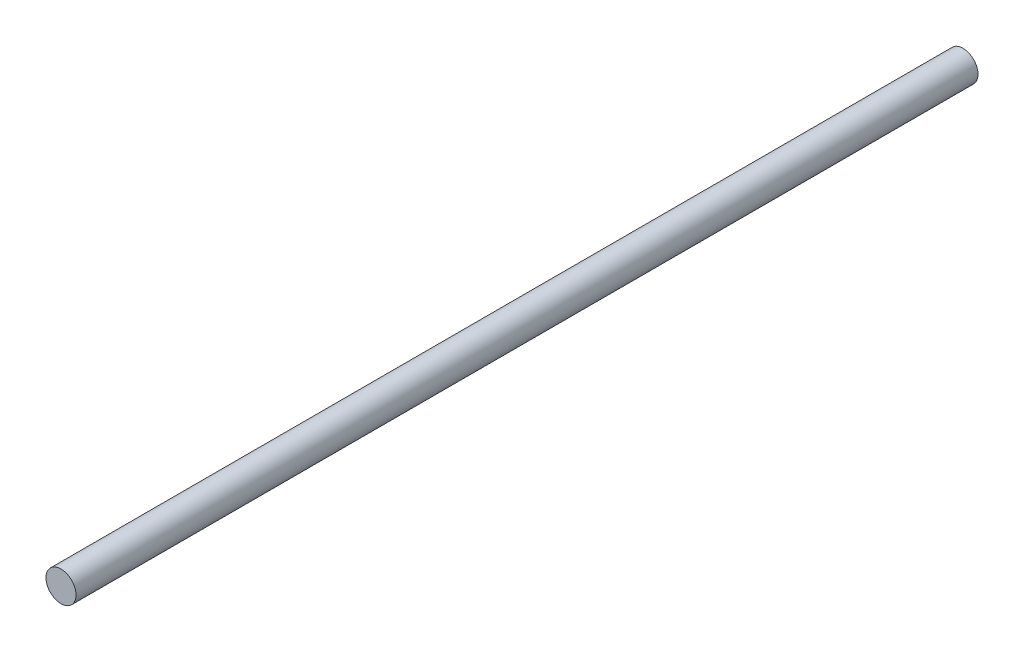
ISO-10303-21;
HEADER;
FILE_DESCRIPTION(('STEP AP214'),'2;1');
FILE_NAME('part.step','',(''),(''),'','','');
FILE_SCHEMA(('AUTOMOTIVE_DESIGN { 1 0 10303 214 1 1 1 1 }'));
ENDSEC;
DATA;
#1=APPLICATION_CONTEXT('core data for automotive mechanical design processes');
#2=APPLICATION_PROTOCOL_DEFINITION('international standard','automotive_design',2000,#1);
#3=PRODUCT_CONTEXT('',#1,'mechanical');
#4=PRODUCT('Part','Part','',(#3));
#5=PRODUCT_RELATED_PRODUCT_CATEGORY('part','',(#4));
#6=PRODUCT_DEFINITION_FORMATION('','',#4);
#7=PRODUCT_DEFINITION_CONTEXT('part definition',#1,'design');
#8=PRODUCT_DEFINITION('design','',#6,#7);
#9=PRODUCT_DEFINITION_SHAPE('','',#8);
#10=(LENGTH_UNIT() NAMED_UNIT(*) SI_UNIT(.MILLI.,.METRE.));
#11=(NAMED_UNIT(*) PLANE_ANGLE_UNIT() SI_UNIT($,.RADIAN.));
#12=(NAMED_UNIT(*) SI_UNIT($,.STERADIAN.) SOLID_ANGLE_UNIT());
#13=UNCERTAINTY_MEASURE_WITH_UNIT(LENGTH_MEASURE(1.E-05),#10,'distance_accuracy_value','');
#14=(GEOMETRIC_REPRESENTATION_CONTEXT(3) GLOBAL_UNCERTAINTY_ASSIGNED_CONTEXT((#13)) GLOBAL_UNIT_ASSIGNED_CONTEXT((#10,
#11,#12)) REPRESENTATION_CONTEXT('',''));
#15=CARTESIAN_POINT('',(0.,0.,0.));
#16=DIRECTION('',(0.,0.,1.));
#17=DIRECTION('',(1.,0.,0.));
#18=AXIS2_PLACEMENT_3D('',#15,#16,#17);
#19=CARTESIAN_POINT('',(2.85489351682311,19.4744522040434,150.));
#20=DIRECTION('',(0.,0.,-1.));
#21=DIRECTION('',(-1.,0.,0.));
#22=AXIS2_PLACEMENT_3D('',#19,#20,#21);
#23=CYLINDRICAL_SURFACE('',#22,2.5);
#24=CARTESIAN_POINT('',(2.85489351682311,19.4744522040434,150.));
#25=DIRECTION('',(0.,0.,1.));
#26=DIRECTION('',(1.,0.,0.));
#27=AXIS2_PLACEMENT_3D('',#24,#25,#26);
#28=CIRCLE('',#27,2.5);
#29=CARTESIAN_POINT('',(5.35489351682311,19.4744522040434,150.));
#30=VERTEX_POINT('',#29);
#31=EDGE_CURVE('E10',#30,#30,#28,.T.);
#32=ORIENTED_EDGE('',*,*,#31,.F.);
#33=EDGE_LOOP('',(#32));
#34=FACE_BOUND('',#33,.T.);
#35=CARTESIAN_POINT('',(2.85489351682311,19.4744522040434,0.));
#36=DIRECTION('',(0.,0.,1.));
#37=DIRECTION('',(1.,0.,0.));
#38=AXIS2_PLACEMENT_3D('',#35,#36,#37);
#39=CIRCLE('',#38,2.5);
#40=CARTESIAN_POINT('',(5.35489351682311,19.4744522040434,0.));
#41=VERTEX_POINT('',#40);
#42=EDGE_CURVE('E34',#41,#41,#39,.T.);
#43=ORIENTED_EDGE('',*,*,#42,.T.);
#44=EDGE_LOOP('',(#43));
#45=FACE_BOUND('',#44,.T.);
#46=ADVANCED_FACE('F31',(#34,#45),#23,.T.);
#47=CARTESIAN_POINT('',(2.85489351682311,19.4744522040434,150.));
#48=DIRECTION('',(0.,0.,1.));
#49=DIRECTION('',(1.,0.,0.));
#50=AXIS2_PLACEMENT_3D('',#47,#48,#49);
#51=PLANE('',#50);
#52=ORIENTED_EDGE('',*,*,#31,.T.);
#53=EDGE_LOOP('',(#52));
#54=FACE_BOUND('',#53,.T.);
#55=ADVANCED_FACE('F46',(#54),#51,.T.);
#56=CARTESIAN_POINT('',(2.85489351682311,19.4744522040434,0.));
#57=DIRECTION('',(0.,0.,1.));
#58=DIRECTION('',(1.,0.,0.));
#59=AXIS2_PLACEMENT_3D('',#56,#57,#58);
#60=PLANE('',#59);
#61=ORIENTED_EDGE('',*,*,#42,.F.);
#62=EDGE_LOOP('',(#61));
#63=FACE_BOUND('',#62,.T.);
#64=ADVANCED_FACE('F44',(#63),#60,.F.);
#65=CLOSED_SHELL('',(#46,#55,#64));
#66=MANIFOLD_SOLID_BREP('B2',#65);
#67=ADVANCED_BREP_SHAPE_REPRESENTATION('',(#18,#66),#14);
#68=SHAPE_DEFINITION_REPRESENTATION(#9,#67);
ENDSEC;
END-ISO-10303-21;
